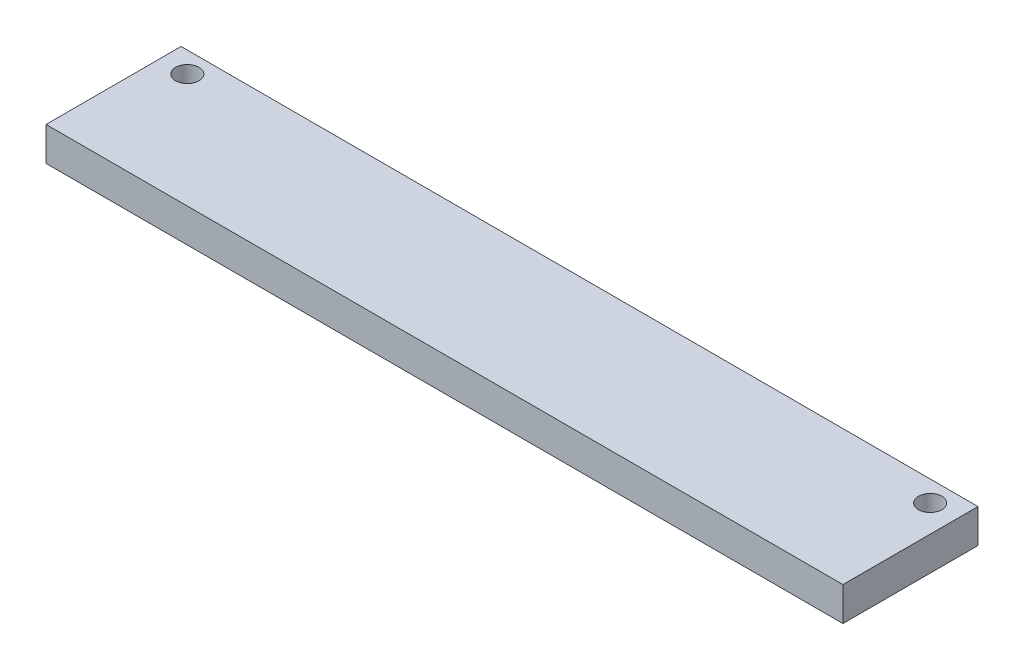
ISO-10303-21;
HEADER;
FILE_DESCRIPTION(('STEP AP214'),'2;1');
FILE_NAME('part.step','',(''),(''),'','','');
FILE_SCHEMA(('AUTOMOTIVE_DESIGN { 1 0 10303 214 1 1 1 1 }'));
ENDSEC;
DATA;
#1=APPLICATION_CONTEXT('core data for automotive mechanical design processes');
#2=APPLICATION_PROTOCOL_DEFINITION('international standard','automotive_design',2000,#1);
#3=PRODUCT_CONTEXT('',#1,'mechanical');
#4=PRODUCT('Part','Part','',(#3));
#5=PRODUCT_RELATED_PRODUCT_CATEGORY('part','',(#4));
#6=PRODUCT_DEFINITION_FORMATION('','',#4);
#7=PRODUCT_DEFINITION_CONTEXT('part definition',#1,'design');
#8=PRODUCT_DEFINITION('design','',#6,#7);
#9=PRODUCT_DEFINITION_SHAPE('','',#8);
#10=(LENGTH_UNIT() NAMED_UNIT(*) SI_UNIT(.MILLI.,.METRE.));
#11=(NAMED_UNIT(*) PLANE_ANGLE_UNIT() SI_UNIT($,.RADIAN.));
#12=(NAMED_UNIT(*) SI_UNIT($,.STERADIAN.) SOLID_ANGLE_UNIT());
#13=UNCERTAINTY_MEASURE_WITH_UNIT(LENGTH_MEASURE(1.E-05),#10,'distance_accuracy_value','');
#14=(GEOMETRIC_REPRESENTATION_CONTEXT(3) GLOBAL_UNCERTAINTY_ASSIGNED_CONTEXT((#13)) GLOBAL_UNIT_ASSIGNED_CONTEXT((#10,
#11,#12)) REPRESENTATION_CONTEXT('',''));
#15=CARTESIAN_POINT('',(0.,0.,0.));
#16=DIRECTION('',(0.,0.,1.));
#17=DIRECTION('',(1.,0.,0.));
#18=AXIS2_PLACEMENT_3D('',#15,#16,#17);
#19=CARTESIAN_POINT('',(-44.8955976868065,3.175,-5.69501312688125));
#20=DIRECTION('',(1.,0.,0.));
#21=DIRECTION('',(0.,0.,-1.));
#22=AXIS2_PLACEMENT_3D('',#19,#20,#21);
#23=PLANE('',#22);
#24=DIRECTION('',(0.,0.,1.));
#25=VECTOR('',#24,1.);
#26=CARTESIAN_POINT('',(-44.8955976868065,0.,-5.69501312688125));
#27=LINE('',#26,#25);
#28=CARTESIAN_POINT('',(-44.8955976868065,0.,-5.69501312688125));
#29=VERTEX_POINT('',#28);
#30=CARTESIAN_POINT('',(-44.8955976868065,0.,7.00498687311875));
#31=VERTEX_POINT('',#30);
#32=EDGE_CURVE('E97',#29,#31,#27,.T.);
#33=ORIENTED_EDGE('',*,*,#32,.T.);
#34=DIRECTION('',(0.,-1.,0.));
#35=VECTOR('',#34,1.);
#36=CARTESIAN_POINT('',(-44.8955976868065,3.175,7.00498687311875));
#37=LINE('',#36,#35);
#38=CARTESIAN_POINT('',(-44.8955976868065,3.175,7.00498687311875));
#39=VERTEX_POINT('',#38);
#40=EDGE_CURVE('E11',#39,#31,#37,.T.);
#41=ORIENTED_EDGE('',*,*,#40,.F.);
#42=DIRECTION('',(0.,0.,1.));
#43=VECTOR('',#42,1.);
#44=CARTESIAN_POINT('',(-44.8955976868065,3.175,-5.69501312688125));
#45=LINE('',#44,#43);
#46=CARTESIAN_POINT('',(-44.8955976868065,3.175,-5.69501312688125));
#47=VERTEX_POINT('',#46);
#48=EDGE_CURVE('E85',#47,#39,#45,.T.);
#49=ORIENTED_EDGE('',*,*,#48,.F.);
#50=DIRECTION('',(0.,-1.,0.));
#51=VECTOR('',#50,1.);
#52=CARTESIAN_POINT('',(-44.8955976868065,3.175,-5.69501312688125));
#53=LINE('',#52,#51);
#54=EDGE_CURVE('E93',#47,#29,#53,.T.);
#55=ORIENTED_EDGE('',*,*,#54,.T.);
#56=EDGE_LOOP('',(#33,#41,#49,#55));
#57=FACE_BOUND('',#56,.T.);
#58=ADVANCED_FACE('F34',(#57),#23,.F.);
#59=CARTESIAN_POINT('',(-44.8955976868065,3.175,7.00498687311875));
#60=DIRECTION('',(0.,0.,-1.));
#61=DIRECTION('',(-1.,0.,0.));
#62=AXIS2_PLACEMENT_3D('',#59,#60,#61);
#63=PLANE('',#62);
#64=DIRECTION('',(1.,0.,0.));
#65=VECTOR('',#64,1.);
#66=CARTESIAN_POINT('',(-44.8955976868065,0.,7.00498687311875));
#67=LINE('',#66,#65);
#68=CARTESIAN_POINT('',(30.0344023131936,0.,7.00498687311875));
#69=VERTEX_POINT('',#68);
#70=EDGE_CURVE('E89',#31,#69,#67,.T.);
#71=ORIENTED_EDGE('',*,*,#70,.T.);
#72=DIRECTION('',(0.,-1.,0.));
#73=VECTOR('',#72,1.);
#74=CARTESIAN_POINT('',(30.0344023131936,3.175,7.00498687311875));
#75=LINE('',#74,#73);
#76=CARTESIAN_POINT('',(30.0344023131936,3.175,7.00498687311875));
#77=VERTEX_POINT('',#76);
#78=EDGE_CURVE('E42',#77,#69,#75,.T.);
#79=ORIENTED_EDGE('',*,*,#78,.F.);
#80=DIRECTION('',(1.,0.,0.));
#81=VECTOR('',#80,1.);
#82=CARTESIAN_POINT('',(-44.8955976868065,3.175,7.00498687311875));
#83=LINE('',#82,#81);
#84=EDGE_CURVE('E80',#39,#77,#83,.T.);
#85=ORIENTED_EDGE('',*,*,#84,.F.);
#86=ORIENTED_EDGE('',*,*,#40,.T.);
#87=EDGE_LOOP('',(#71,#79,#85,#86));
#88=FACE_BOUND('',#87,.T.);
#89=ADVANCED_FACE('F88',(#88),#63,.F.);
#90=CARTESIAN_POINT('',(30.0344023131936,3.175,-5.69501312688125));
#91=DIRECTION('',(-1.,0.,0.));
#92=DIRECTION('',(0.,0.,1.));
#93=AXIS2_PLACEMENT_3D('',#90,#91,#92);
#94=PLANE('',#93);
#95=DIRECTION('',(0.,0.,-1.));
#96=VECTOR('',#95,1.);
#97=CARTESIAN_POINT('',(30.0344023131936,0.,-5.69501312688125));
#98=LINE('',#97,#96);
#99=CARTESIAN_POINT('',(30.0344023131936,0.,-5.69501312688125));
#100=VERTEX_POINT('',#99);
#101=EDGE_CURVE('E67',#69,#100,#98,.T.);
#102=ORIENTED_EDGE('',*,*,#101,.T.);
#103=DIRECTION('',(0.,-1.,0.));
#104=VECTOR('',#103,1.);
#105=CARTESIAN_POINT('',(30.0344023131936,3.175,-5.69501312688125));
#106=LINE('',#105,#104);
#107=CARTESIAN_POINT('',(30.0344023131936,3.175,-5.69501312688125));
#108=VERTEX_POINT('',#107);
#109=EDGE_CURVE('E90',#108,#100,#106,.T.);
#110=ORIENTED_EDGE('',*,*,#109,.F.);
#111=DIRECTION('',(0.,0.,-1.));
#112=VECTOR('',#111,1.);
#113=CARTESIAN_POINT('',(30.0344023131936,3.175,-5.69501312688125));
#114=LINE('',#113,#112);
#115=EDGE_CURVE('E83',#77,#108,#114,.T.);
#116=ORIENTED_EDGE('',*,*,#115,.F.);
#117=ORIENTED_EDGE('',*,*,#78,.T.);
#118=EDGE_LOOP('',(#102,#110,#116,#117));
#119=FACE_BOUND('',#118,.T.);
#120=ADVANCED_FACE('F91',(#119),#94,.F.);
#121=CARTESIAN_POINT('',(-44.8955976868065,3.175,-5.69501312688125));
#122=DIRECTION('',(0.,0.,1.));
#123=DIRECTION('',(1.,0.,0.));
#124=AXIS2_PLACEMENT_3D('',#121,#122,#123);
#125=PLANE('',#124);
#126=DIRECTION('',(-1.,0.,0.));
#127=VECTOR('',#126,1.);
#128=CARTESIAN_POINT('',(-44.8955976868065,0.,-5.69501312688125));
#129=LINE('',#128,#127);
#130=EDGE_CURVE('E73',#100,#29,#129,.T.);
#131=ORIENTED_EDGE('',*,*,#130,.T.);
#132=ORIENTED_EDGE('',*,*,#54,.F.);
#133=DIRECTION('',(-1.,0.,0.));
#134=VECTOR('',#133,1.);
#135=CARTESIAN_POINT('',(-44.8955976868065,3.175,-5.69501312688125));
#136=LINE('',#135,#134);
#137=EDGE_CURVE('E50',#108,#47,#136,.T.);
#138=ORIENTED_EDGE('',*,*,#137,.F.);
#139=ORIENTED_EDGE('',*,*,#109,.T.);
#140=EDGE_LOOP('',(#131,#132,#138,#139));
#141=FACE_BOUND('',#140,.T.);
#142=ADVANCED_FACE('F105',(#141),#125,.F.);
#143=CARTESIAN_POINT('',(0.,3.175,0.));
#144=DIRECTION('',(0.,1.,0.));
#145=DIRECTION('',(0.,0.,1.));
#146=AXIS2_PLACEMENT_3D('',#143,#144,#145);
#147=PLANE('',#146);
#148=CARTESIAN_POINT('',(-42.3555976868064,3.175,-3.73919256098532));
#149=DIRECTION('',(0.,1.,0.));
#150=DIRECTION('',(0.,0.,1.));
#151=AXIS2_PLACEMENT_3D('',#148,#149,#150);
#152=CIRCLE('',#151,1.1);
#153=CARTESIAN_POINT('',(-42.3555976868064,3.175,-2.63919256098532));
#154=VERTEX_POINT('',#153);
#155=EDGE_CURVE('E116',#154,#154,#152,.T.);
#156=ORIENTED_EDGE('',*,*,#155,.F.);
#157=EDGE_LOOP('',(#156));
#158=FACE_BOUND('',#157,.T.);
#159=CARTESIAN_POINT('',(27.4944023131936,3.175,-3.73919256098532));
#160=DIRECTION('',(0.,1.,0.));
#161=DIRECTION('',(0.,0.,1.));
#162=AXIS2_PLACEMENT_3D('',#159,#160,#161);
#163=CIRCLE('',#162,1.1);
#164=CARTESIAN_POINT('',(27.4944023131936,3.175,-2.63919256098532));
#165=VERTEX_POINT('',#164);
#166=EDGE_CURVE('E100',#165,#165,#163,.T.);
#167=ORIENTED_EDGE('',*,*,#166,.F.);
#168=EDGE_LOOP('',(#167));
#169=FACE_BOUND('',#168,.T.);
#170=ORIENTED_EDGE('',*,*,#48,.T.);
#171=ORIENTED_EDGE('',*,*,#84,.T.);
#172=ORIENTED_EDGE('',*,*,#115,.T.);
#173=ORIENTED_EDGE('',*,*,#137,.T.);
#174=EDGE_LOOP('',(#170,#171,#172,#173));
#175=FACE_BOUND('',#174,.T.);
#176=ADVANCED_FACE('F81',(#158,#169,#175),#147,.T.);
#177=CARTESIAN_POINT('',(0.,0.,0.));
#178=DIRECTION('',(0.,1.,0.));
#179=DIRECTION('',(0.,0.,1.));
#180=AXIS2_PLACEMENT_3D('',#177,#178,#179);
#181=PLANE('',#180);
#182=CARTESIAN_POINT('',(-42.3555976868064,0.,-3.73919256098532));
#183=DIRECTION('',(0.,-1.,0.));
#184=DIRECTION('',(0.,0.,-1.));
#185=AXIS2_PLACEMENT_3D('',#182,#183,#184);
#186=CIRCLE('',#185,1.1);
#187=CARTESIAN_POINT('',(-42.3555976868064,0.,-4.83919256098531));
#188=VERTEX_POINT('',#187);
#189=EDGE_CURVE('E119',#188,#188,#186,.T.);
#190=ORIENTED_EDGE('',*,*,#189,.F.);
#191=EDGE_LOOP('',(#190));
#192=FACE_BOUND('',#191,.T.);
#193=CARTESIAN_POINT('',(27.4944023131936,0.,-3.73919256098532));
#194=DIRECTION('',(0.,-1.,0.));
#195=DIRECTION('',(0.,0.,-1.));
#196=AXIS2_PLACEMENT_3D('',#193,#194,#195);
#197=CIRCLE('',#196,1.1);
#198=CARTESIAN_POINT('',(27.4944023131936,0.,-4.83919256098532));
#199=VERTEX_POINT('',#198);
#200=EDGE_CURVE('E113',#199,#199,#197,.T.);
#201=ORIENTED_EDGE('',*,*,#200,.F.);
#202=EDGE_LOOP('',(#201));
#203=FACE_BOUND('',#202,.T.);
#204=ORIENTED_EDGE('',*,*,#32,.F.);
#205=ORIENTED_EDGE('',*,*,#130,.F.);
#206=ORIENTED_EDGE('',*,*,#101,.F.);
#207=ORIENTED_EDGE('',*,*,#70,.F.);
#208=EDGE_LOOP('',(#204,#205,#206,#207));
#209=FACE_BOUND('',#208,.T.);
#210=ADVANCED_FACE('F108',(#192,#203,#209),#181,.F.);
#211=CARTESIAN_POINT('',(27.4944023131936,12.175,-3.73919256098532));
#212=DIRECTION('',(0.,-1.,0.));
#213=DIRECTION('',(0.,0.,-1.));
#214=AXIS2_PLACEMENT_3D('',#211,#212,#213);
#215=CYLINDRICAL_SURFACE('',#214,1.1);
#216=ORIENTED_EDGE('',*,*,#166,.T.);
#217=EDGE_LOOP('',(#216));
#218=FACE_BOUND('',#217,.T.);
#219=ORIENTED_EDGE('',*,*,#200,.T.);
#220=EDGE_LOOP('',(#219));
#221=FACE_BOUND('',#220,.T.);
#222=ADVANCED_FACE('F127',(#218,#221),#215,.F.);
#223=CARTESIAN_POINT('',(-42.3555976868064,12.175,-3.73919256098532));
#224=DIRECTION('',(0.,-1.,0.));
#225=DIRECTION('',(0.,0.,-1.));
#226=AXIS2_PLACEMENT_3D('',#223,#224,#225);
#227=CYLINDRICAL_SURFACE('',#226,1.1);
#228=ORIENTED_EDGE('',*,*,#155,.T.);
#229=EDGE_LOOP('',(#228));
#230=FACE_BOUND('',#229,.T.);
#231=ORIENTED_EDGE('',*,*,#189,.T.);
#232=EDGE_LOOP('',(#231));
#233=FACE_BOUND('',#232,.T.);
#234=ADVANCED_FACE('F123',(#230,#233),#227,.F.);
#235=CLOSED_SHELL('',(#58,#89,#120,#142,#176,#210,#222,#234));
#236=MANIFOLD_SOLID_BREP('B2',#235);
#237=ADVANCED_BREP_SHAPE_REPRESENTATION('',(#18,#236),#14);
#238=SHAPE_DEFINITION_REPRESENTATION(#9,#237);
ENDSEC;
END-ISO-10303-21;
